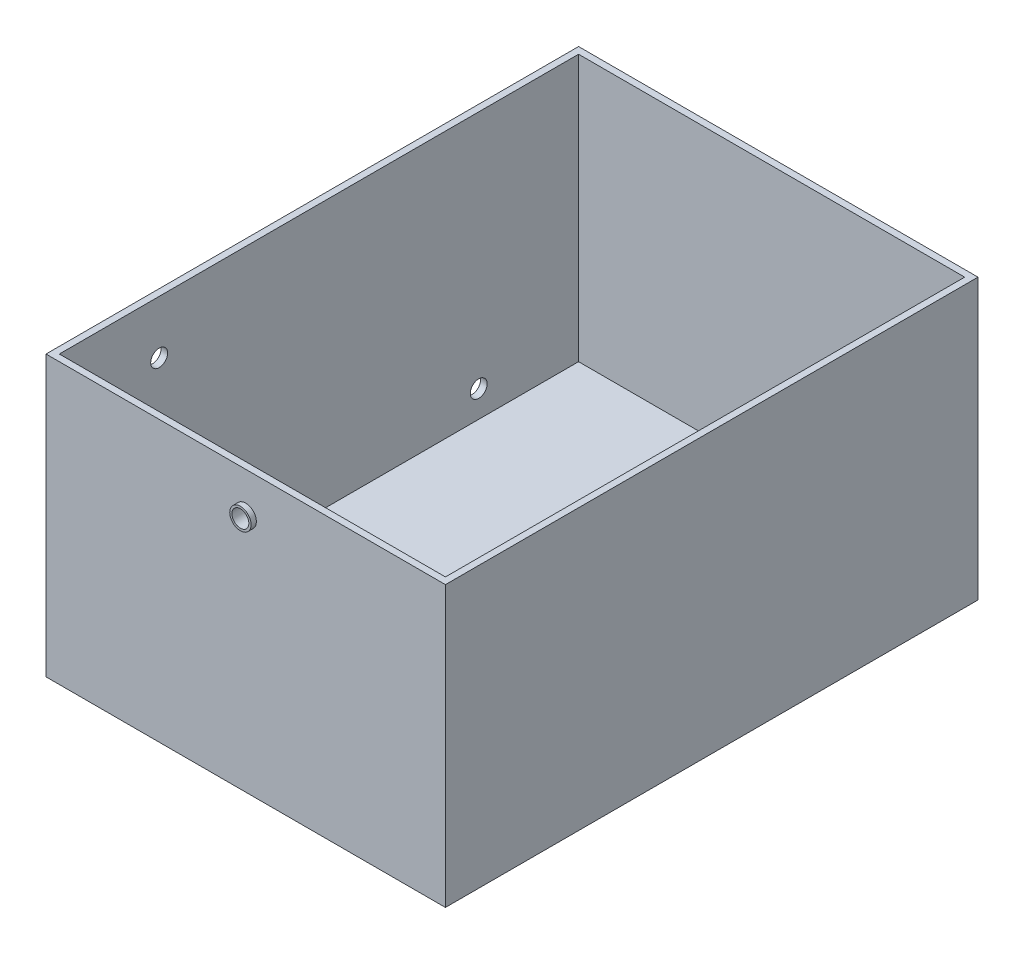
ISO-10303-21;
HEADER;
FILE_DESCRIPTION(('STEP AP214'),'2;1');
FILE_NAME('part.step','',(''),(''),'','','');
FILE_SCHEMA(('AUTOMOTIVE_DESIGN { 1 0 10303 214 1 1 1 1 }'));
ENDSEC;
DATA;
#1=APPLICATION_CONTEXT('core data for automotive mechanical design processes');
#2=APPLICATION_PROTOCOL_DEFINITION('international standard','automotive_design',2000,#1);
#3=PRODUCT_CONTEXT('',#1,'mechanical');
#4=PRODUCT('Part','Part','',(#3));
#5=PRODUCT_RELATED_PRODUCT_CATEGORY('part','',(#4));
#6=PRODUCT_DEFINITION_FORMATION('','',#4);
#7=PRODUCT_DEFINITION_CONTEXT('part definition',#1,'design');
#8=PRODUCT_DEFINITION('design','',#6,#7);
#9=PRODUCT_DEFINITION_SHAPE('','',#8);
#10=(LENGTH_UNIT() NAMED_UNIT(*) SI_UNIT(.MILLI.,.METRE.));
#11=(NAMED_UNIT(*) PLANE_ANGLE_UNIT() SI_UNIT($,.RADIAN.));
#12=(NAMED_UNIT(*) SI_UNIT($,.STERADIAN.) SOLID_ANGLE_UNIT());
#13=UNCERTAINTY_MEASURE_WITH_UNIT(LENGTH_MEASURE(1.E-05),#10,'distance_accuracy_value','');
#14=(GEOMETRIC_REPRESENTATION_CONTEXT(3) GLOBAL_UNCERTAINTY_ASSIGNED_CONTEXT((#13)) GLOBAL_UNIT_ASSIGNED_CONTEXT((#10,
#11,#12)) REPRESENTATION_CONTEXT('',''));
#15=CARTESIAN_POINT('',(0.,0.,0.));
#16=DIRECTION('',(0.,0.,1.));
#17=DIRECTION('',(1.,0.,0.));
#18=AXIS2_PLACEMENT_3D('',#15,#16,#17);
#19=CARTESIAN_POINT('',(-75.,5.,-100.));
#20=DIRECTION('',(0.,0.,1.));
#21=DIRECTION('',(1.,0.,0.));
#22=AXIS2_PLACEMENT_3D('',#19,#20,#21);
#23=PLANE('',#22);
#24=DIRECTION('',(-1.,0.,0.));
#25=VECTOR('',#24,1.);
#26=CARTESIAN_POINT('',(-75.,0.,-100.));
#27=LINE('',#26,#25);
#28=CARTESIAN_POINT('',(75.,0.,-100.));
#29=VERTEX_POINT('',#28);
#30=CARTESIAN_POINT('',(-75.,0.,-100.));
#31=VERTEX_POINT('',#30);
#32=EDGE_CURVE('E166',#29,#31,#27,.T.);
#33=ORIENTED_EDGE('',*,*,#32,.T.);
#34=DIRECTION('',(0.,-1.,0.));
#35=VECTOR('',#34,1.);
#36=CARTESIAN_POINT('',(-75.,5.,-100.));
#37=LINE('',#36,#35);
#38=CARTESIAN_POINT('',(-75.0000000000001,105.,-100.));
#39=VERTEX_POINT('',#38);
#40=EDGE_CURVE('E175',#39,#31,#37,.T.);
#41=ORIENTED_EDGE('',*,*,#40,.F.);
#42=DIRECTION('',(-1.,0.,0.));
#43=VECTOR('',#42,1.);
#44=CARTESIAN_POINT('',(-75.0000000000001,105.,-100.));
#45=LINE('',#44,#43);
#46=CARTESIAN_POINT('',(75.,105.,-100.));
#47=VERTEX_POINT('',#46);
#48=EDGE_CURVE('E154',#47,#39,#45,.T.);
#49=ORIENTED_EDGE('',*,*,#48,.F.);
#50=DIRECTION('',(0.,-1.,0.));
#51=VECTOR('',#50,1.);
#52=CARTESIAN_POINT('',(75.,5.,-100.));
#53=LINE('',#52,#51);
#54=EDGE_CURVE('E178',#47,#29,#53,.T.);
#55=ORIENTED_EDGE('',*,*,#54,.T.);
#56=EDGE_LOOP('',(#33,#41,#49,#55));
#57=FACE_BOUND('',#56,.T.);
#58=CARTESIAN_POINT('',(0.,10.,-100.));
#59=DIRECTION('',(0.,0.,1.));
#60=DIRECTION('',(1.,0.,0.));
#61=AXIS2_PLACEMENT_3D('',#58,#59,#60);
#62=CIRCLE('',#61,4.);
#63=CARTESIAN_POINT('',(4.,10.,-100.));
#64=VERTEX_POINT('',#63);
#65=EDGE_CURVE('E11',#64,#64,#62,.F.);
#66=ORIENTED_EDGE('',*,*,#65,.F.);
#67=EDGE_LOOP('',(#66));
#68=FACE_BOUND('',#67,.T.);
#69=ADVANCED_FACE('F41',(#57,#68),#23,.F.);
#70=CARTESIAN_POINT('',(-75.,5.,100.));
#71=DIRECTION('',(0.,0.,-1.));
#72=DIRECTION('',(-1.,0.,0.));
#73=AXIS2_PLACEMENT_3D('',#70,#71,#72);
#74=PLANE('',#73);
#75=DIRECTION('',(1.,0.,0.));
#76=VECTOR('',#75,1.);
#77=CARTESIAN_POINT('',(-75.,0.,100.));
#78=LINE('',#77,#76);
#79=CARTESIAN_POINT('',(-75.,0.,100.));
#80=VERTEX_POINT('',#79);
#81=CARTESIAN_POINT('',(75.,0.,100.));
#82=VERTEX_POINT('',#81);
#83=EDGE_CURVE('E66',#80,#82,#78,.T.);
#84=ORIENTED_EDGE('',*,*,#83,.T.);
#85=DIRECTION('',(0.,-1.,0.));
#86=VECTOR('',#85,1.);
#87=CARTESIAN_POINT('',(75.,5.,100.));
#88=LINE('',#87,#86);
#89=CARTESIAN_POINT('',(75.,105.,100.));
#90=VERTEX_POINT('',#89);
#91=EDGE_CURVE('E171',#90,#82,#88,.T.);
#92=ORIENTED_EDGE('',*,*,#91,.F.);
#93=DIRECTION('',(1.,0.,0.));
#94=VECTOR('',#93,1.);
#95=CARTESIAN_POINT('',(-75.0000000000001,105.,100.));
#96=LINE('',#95,#94);
#97=CARTESIAN_POINT('',(-75.0000000000001,105.,100.));
#98=VERTEX_POINT('',#97);
#99=EDGE_CURVE('E160',#98,#90,#96,.T.);
#100=ORIENTED_EDGE('',*,*,#99,.F.);
#101=DIRECTION('',(0.,-1.,0.));
#102=VECTOR('',#101,1.);
#103=CARTESIAN_POINT('',(-75.,5.,100.));
#104=LINE('',#103,#102);
#105=EDGE_CURVE('E173',#98,#80,#104,.T.);
#106=ORIENTED_EDGE('',*,*,#105,.T.);
#107=EDGE_LOOP('',(#84,#92,#100,#106));
#108=FACE_BOUND('',#107,.T.);
#109=CARTESIAN_POINT('',(0.,90.,100.));
#110=DIRECTION('',(0.,0.,-1.));
#111=DIRECTION('',(-1.,0.,0.));
#112=AXIS2_PLACEMENT_3D('',#109,#110,#111);
#113=CIRCLE('',#112,4.);
#114=CARTESIAN_POINT('',(-4.,90.,100.));
#115=VERTEX_POINT('',#114);
#116=EDGE_CURVE('E50',#115,#115,#113,.F.);
#117=ORIENTED_EDGE('',*,*,#116,.F.);
#118=EDGE_LOOP('',(#117));
#119=FACE_BOUND('',#118,.T.);
#120=ADVANCED_FACE('F223',(#108,#119),#74,.F.);
#121=CARTESIAN_POINT('',(75.,5.,100.));
#122=DIRECTION('',(-1.,0.,0.));
#123=DIRECTION('',(0.,0.,1.));
#124=AXIS2_PLACEMENT_3D('',#121,#122,#123);
#125=PLANE('',#124);
#126=DIRECTION('',(0.,0.,-1.));
#127=VECTOR('',#126,1.);
#128=CARTESIAN_POINT('',(75.,0.,100.));
#129=LINE('',#128,#127);
#130=EDGE_CURVE('E163',#82,#29,#129,.T.);
#131=ORIENTED_EDGE('',*,*,#130,.T.);
#132=ORIENTED_EDGE('',*,*,#54,.F.);
#133=DIRECTION('',(0.,0.,-1.));
#134=VECTOR('',#133,1.);
#135=CARTESIAN_POINT('',(75.,105.,-100.));
#136=LINE('',#135,#134);
#137=EDGE_CURVE('E126',#90,#47,#136,.T.);
#138=ORIENTED_EDGE('',*,*,#137,.F.);
#139=ORIENTED_EDGE('',*,*,#91,.T.);
#140=EDGE_LOOP('',(#131,#132,#138,#139));
#141=FACE_BOUND('',#140,.T.);
#142=ADVANCED_FACE('F43',(#141),#125,.F.);
#143=CARTESIAN_POINT('',(-75.,5.,100.));
#144=DIRECTION('',(1.,0.,0.));
#145=DIRECTION('',(0.,0.,-1.));
#146=AXIS2_PLACEMENT_3D('',#143,#144,#145);
#147=PLANE('',#146);
#148=CARTESIAN_POINT('',(-75.,15.0000000000001,-60.));
#149=DIRECTION('',(-1.,0.,0.));
#150=DIRECTION('',(0.,0.,1.));
#151=AXIS2_PLACEMENT_3D('',#148,#149,#150);
#152=CIRCLE('',#151,3.17499999609346);
#153=CARTESIAN_POINT('',(-75.,15.0000000000001,-56.8250000039065));
#154=VERTEX_POINT('',#153);
#155=EDGE_CURVE('E192',#154,#154,#152,.T.);
#156=ORIENTED_EDGE('',*,*,#155,.F.);
#157=EDGE_LOOP('',(#156));
#158=FACE_BOUND('',#157,.T.);
#159=CARTESIAN_POINT('',(-75.,85.,60.));
#160=DIRECTION('',(-1.,0.,0.));
#161=DIRECTION('',(0.,0.,1.));
#162=AXIS2_PLACEMENT_3D('',#159,#160,#161);
#163=CIRCLE('',#162,3.175);
#164=CARTESIAN_POINT('',(-75.,85.,63.175));
#165=VERTEX_POINT('',#164);
#166=EDGE_CURVE('E198',#165,#165,#163,.T.);
#167=ORIENTED_EDGE('',*,*,#166,.F.);
#168=EDGE_LOOP('',(#167));
#169=FACE_BOUND('',#168,.T.);
#170=DIRECTION('',(0.,0.,1.));
#171=VECTOR('',#170,1.);
#172=CARTESIAN_POINT('',(-75.,0.,100.));
#173=LINE('',#172,#171);
#174=EDGE_CURVE('E168',#31,#80,#173,.T.);
#175=ORIENTED_EDGE('',*,*,#174,.T.);
#176=ORIENTED_EDGE('',*,*,#105,.F.);
#177=DIRECTION('',(0.,0.,1.));
#178=VECTOR('',#177,1.);
#179=CARTESIAN_POINT('',(-75.0000000000001,105.,-100.));
#180=LINE('',#179,#178);
#181=EDGE_CURVE('E157',#39,#98,#180,.T.);
#182=ORIENTED_EDGE('',*,*,#181,.F.);
#183=ORIENTED_EDGE('',*,*,#40,.T.);
#184=EDGE_LOOP('',(#175,#176,#182,#183));
#185=FACE_BOUND('',#184,.T.);
#186=ADVANCED_FACE('F231',(#158,#169,#185),#147,.F.);
#187=CARTESIAN_POINT('',(0.,0.,0.));
#188=DIRECTION('',(0.,-1.,0.));
#189=DIRECTION('',(0.,0.,-1.));
#190=AXIS2_PLACEMENT_3D('',#187,#188,#189);
#191=PLANE('',#190);
#192=ORIENTED_EDGE('',*,*,#130,.F.);
#193=ORIENTED_EDGE('',*,*,#83,.F.);
#194=ORIENTED_EDGE('',*,*,#174,.F.);
#195=ORIENTED_EDGE('',*,*,#32,.F.);
#196=EDGE_LOOP('',(#192,#193,#194,#195));
#197=FACE_BOUND('',#196,.T.);
#198=ADVANCED_FACE('F237',(#197),#191,.T.);
#199=CARTESIAN_POINT('',(0.,105.,0.));
#200=DIRECTION('',(0.,1.,0.));
#201=DIRECTION('',(0.,0.,1.));
#202=AXIS2_PLACEMENT_3D('',#199,#200,#201);
#203=PLANE('',#202);
#204=ORIENTED_EDGE('',*,*,#137,.T.);
#205=ORIENTED_EDGE('',*,*,#48,.T.);
#206=ORIENTED_EDGE('',*,*,#181,.T.);
#207=ORIENTED_EDGE('',*,*,#99,.T.);
#208=EDGE_LOOP('',(#204,#205,#206,#207));
#209=FACE_BOUND('',#208,.T.);
#210=DIRECTION('',(-1.,0.,0.));
#211=VECTOR('',#210,1.);
#212=CARTESIAN_POINT('',(-72.5,105.,-97.5));
#213=LINE('',#212,#211);
#214=CARTESIAN_POINT('',(72.5,105.,-97.5));
#215=VERTEX_POINT('',#214);
#216=CARTESIAN_POINT('',(-72.5,105.,-97.5));
#217=VERTEX_POINT('',#216);
#218=EDGE_CURVE('E118',#215,#217,#213,.T.);
#219=ORIENTED_EDGE('',*,*,#218,.F.);
#220=DIRECTION('',(0.,0.,-1.));
#221=VECTOR('',#220,1.);
#222=CARTESIAN_POINT('',(72.5,105.,97.5));
#223=LINE('',#222,#221);
#224=CARTESIAN_POINT('',(72.5,105.,97.5));
#225=VERTEX_POINT('',#224);
#226=EDGE_CURVE('E110',#225,#215,#223,.T.);
#227=ORIENTED_EDGE('',*,*,#226,.F.);
#228=DIRECTION('',(1.,0.,0.));
#229=VECTOR('',#228,1.);
#230=CARTESIAN_POINT('',(-72.5,105.,97.5));
#231=LINE('',#230,#229);
#232=CARTESIAN_POINT('',(-72.5,105.,97.5));
#233=VERTEX_POINT('',#232);
#234=EDGE_CURVE('E134',#233,#225,#231,.T.);
#235=ORIENTED_EDGE('',*,*,#234,.F.);
#236=DIRECTION('',(0.,0.,1.));
#237=VECTOR('',#236,1.);
#238=CARTESIAN_POINT('',(-72.5,105.,97.5));
#239=LINE('',#238,#237);
#240=EDGE_CURVE('E132',#217,#233,#239,.T.);
#241=ORIENTED_EDGE('',*,*,#240,.F.);
#242=EDGE_LOOP('',(#219,#227,#235,#241));
#243=FACE_BOUND('',#242,.T.);
#244=ADVANCED_FACE('F130',(#209,#243),#203,.T.);
#245=CARTESIAN_POINT('',(72.5,105.,97.5));
#246=DIRECTION('',(-1.,0.,0.));
#247=DIRECTION('',(0.,0.,1.));
#248=AXIS2_PLACEMENT_3D('',#245,#246,#247);
#249=PLANE('',#248);
#250=DIRECTION('',(0.,0.,-1.));
#251=VECTOR('',#250,1.);
#252=CARTESIAN_POINT('',(72.5,5.,97.5));
#253=LINE('',#252,#251);
#254=CARTESIAN_POINT('',(72.5,5.,97.5));
#255=VERTEX_POINT('',#254);
#256=CARTESIAN_POINT('',(72.5,5.,-97.5));
#257=VERTEX_POINT('',#256);
#258=EDGE_CURVE('E139',#255,#257,#253,.T.);
#259=ORIENTED_EDGE('',*,*,#258,.F.);
#260=DIRECTION('',(0.,-1.,0.));
#261=VECTOR('',#260,1.);
#262=CARTESIAN_POINT('',(72.5,105.,97.5));
#263=LINE('',#262,#261);
#264=EDGE_CURVE('E58',#225,#255,#263,.T.);
#265=ORIENTED_EDGE('',*,*,#264,.F.);
#266=ORIENTED_EDGE('',*,*,#226,.T.);
#267=DIRECTION('',(0.,-1.,0.));
#268=VECTOR('',#267,1.);
#269=CARTESIAN_POINT('',(72.5,105.,-97.5));
#270=LINE('',#269,#268);
#271=EDGE_CURVE('E113',#215,#257,#270,.T.);
#272=ORIENTED_EDGE('',*,*,#271,.T.);
#273=EDGE_LOOP('',(#259,#265,#266,#272));
#274=FACE_BOUND('',#273,.T.);
#275=ADVANCED_FACE('F112',(#274),#249,.T.);
#276=CARTESIAN_POINT('',(-72.5,105.,-97.5));
#277=DIRECTION('',(0.,0.,1.));
#278=DIRECTION('',(1.,0.,0.));
#279=AXIS2_PLACEMENT_3D('',#276,#277,#278);
#280=PLANE('',#279);
#281=CARTESIAN_POINT('',(0.,10.,-97.5));
#282=DIRECTION('',(0.,0.,1.));
#283=DIRECTION('',(1.,0.,0.));
#284=AXIS2_PLACEMENT_3D('',#281,#282,#283);
#285=CIRCLE('',#284,3.175);
#286=CARTESIAN_POINT('',(3.175,10.,-97.5));
#287=VERTEX_POINT('',#286);
#288=EDGE_CURVE('E186',#287,#287,#285,.T.);
#289=ORIENTED_EDGE('',*,*,#288,.F.);
#290=EDGE_LOOP('',(#289));
#291=FACE_BOUND('',#290,.T.);
#292=DIRECTION('',(-1.,0.,0.));
#293=VECTOR('',#292,1.);
#294=CARTESIAN_POINT('',(-72.5,5.,-97.5));
#295=LINE('',#294,#293);
#296=CARTESIAN_POINT('',(-72.5,5.,-97.5));
#297=VERTEX_POINT('',#296);
#298=EDGE_CURVE('E125',#257,#297,#295,.T.);
#299=ORIENTED_EDGE('',*,*,#298,.F.);
#300=ORIENTED_EDGE('',*,*,#271,.F.);
#301=ORIENTED_EDGE('',*,*,#218,.T.);
#302=DIRECTION('',(0.,-1.,0.));
#303=VECTOR('',#302,1.);
#304=CARTESIAN_POINT('',(-72.5,105.,-97.5));
#305=LINE('',#304,#303);
#306=EDGE_CURVE('E127',#217,#297,#305,.T.);
#307=ORIENTED_EDGE('',*,*,#306,.T.);
#308=EDGE_LOOP('',(#299,#300,#301,#307));
#309=FACE_BOUND('',#308,.T.);
#310=ADVANCED_FACE('F122',(#291,#309),#280,.T.);
#311=CARTESIAN_POINT('',(-72.5,105.,97.5));
#312=DIRECTION('',(1.,0.,0.));
#313=DIRECTION('',(0.,0.,-1.));
#314=AXIS2_PLACEMENT_3D('',#311,#312,#313);
#315=PLANE('',#314);
#316=CARTESIAN_POINT('',(-72.5,15.0000000000001,-60.));
#317=DIRECTION('',(1.,0.,0.));
#318=DIRECTION('',(0.,0.,-1.));
#319=AXIS2_PLACEMENT_3D('',#316,#317,#318);
#320=CIRCLE('',#319,3.17499999609346);
#321=CARTESIAN_POINT('',(-72.5,15.0000000000001,-63.1749999960935));
#322=VERTEX_POINT('',#321);
#323=EDGE_CURVE('E45',#322,#322,#320,.T.);
#324=ORIENTED_EDGE('',*,*,#323,.F.);
#325=EDGE_LOOP('',(#324));
#326=FACE_BOUND('',#325,.T.);
#327=CARTESIAN_POINT('',(-72.5,85.,60.));
#328=DIRECTION('',(1.,0.,0.));
#329=DIRECTION('',(0.,0.,-1.));
#330=AXIS2_PLACEMENT_3D('',#327,#328,#329);
#331=CIRCLE('',#330,3.175);
#332=CARTESIAN_POINT('',(-72.5,85.,56.825));
#333=VERTEX_POINT('',#332);
#334=EDGE_CURVE('E190',#333,#333,#331,.T.);
#335=ORIENTED_EDGE('',*,*,#334,.F.);
#336=EDGE_LOOP('',(#335));
#337=FACE_BOUND('',#336,.T.);
#338=DIRECTION('',(0.,0.,1.));
#339=VECTOR('',#338,1.);
#340=CARTESIAN_POINT('',(-72.5,5.,97.5));
#341=LINE('',#340,#339);
#342=CARTESIAN_POINT('',(-72.5,5.,97.5));
#343=VERTEX_POINT('',#342);
#344=EDGE_CURVE('E143',#297,#343,#341,.T.);
#345=ORIENTED_EDGE('',*,*,#344,.F.);
#346=ORIENTED_EDGE('',*,*,#306,.F.);
#347=ORIENTED_EDGE('',*,*,#240,.T.);
#348=DIRECTION('',(0.,-1.,0.));
#349=VECTOR('',#348,1.);
#350=CARTESIAN_POINT('',(-72.5,105.,97.5));
#351=LINE('',#350,#349);
#352=EDGE_CURVE('E149',#233,#343,#351,.T.);
#353=ORIENTED_EDGE('',*,*,#352,.T.);
#354=EDGE_LOOP('',(#345,#346,#347,#353));
#355=FACE_BOUND('',#354,.T.);
#356=ADVANCED_FACE('F287',(#326,#337,#355),#315,.T.);
#357=CARTESIAN_POINT('',(-72.5,105.,97.5));
#358=DIRECTION('',(0.,0.,-1.));
#359=DIRECTION('',(-1.,0.,0.));
#360=AXIS2_PLACEMENT_3D('',#357,#358,#359);
#361=PLANE('',#360);
#362=CARTESIAN_POINT('',(0.,90.,97.5));
#363=DIRECTION('',(0.,0.,-1.));
#364=DIRECTION('',(-1.,0.,0.));
#365=AXIS2_PLACEMENT_3D('',#362,#363,#364);
#366=CIRCLE('',#365,3.175);
#367=CARTESIAN_POINT('',(-3.175,90.,97.5));
#368=VERTEX_POINT('',#367);
#369=EDGE_CURVE('E141',#368,#368,#366,.T.);
#370=ORIENTED_EDGE('',*,*,#369,.F.);
#371=EDGE_LOOP('',(#370));
#372=FACE_BOUND('',#371,.T.);
#373=DIRECTION('',(1.,0.,0.));
#374=VECTOR('',#373,1.);
#375=CARTESIAN_POINT('',(-72.5,5.,97.5));
#376=LINE('',#375,#374);
#377=EDGE_CURVE('E119',#343,#255,#376,.T.);
#378=ORIENTED_EDGE('',*,*,#377,.F.);
#379=ORIENTED_EDGE('',*,*,#352,.F.);
#380=ORIENTED_EDGE('',*,*,#234,.T.);
#381=ORIENTED_EDGE('',*,*,#264,.T.);
#382=EDGE_LOOP('',(#378,#379,#380,#381));
#383=FACE_BOUND('',#382,.T.);
#384=ADVANCED_FACE('F284',(#372,#383),#361,.T.);
#385=CARTESIAN_POINT('',(0.,5.,0.));
#386=DIRECTION('',(0.,-1.,0.));
#387=DIRECTION('',(0.,0.,-1.));
#388=AXIS2_PLACEMENT_3D('',#385,#386,#387);
#389=PLANE('',#388);
#390=ORIENTED_EDGE('',*,*,#377,.T.);
#391=ORIENTED_EDGE('',*,*,#258,.T.);
#392=ORIENTED_EDGE('',*,*,#298,.T.);
#393=ORIENTED_EDGE('',*,*,#344,.T.);
#394=EDGE_LOOP('',(#390,#391,#392,#393));
#395=FACE_BOUND('',#394,.T.);
#396=ADVANCED_FACE('F282',(#395),#389,.F.);
#397=CARTESIAN_POINT('',(0.,90.,50.));
#398=DIRECTION('',(0.,0.,1.));
#399=DIRECTION('',(1.,0.,0.));
#400=AXIS2_PLACEMENT_3D('',#397,#398,#399);
#401=CYLINDRICAL_SURFACE('',#400,3.175);
#402=ORIENTED_EDGE('',*,*,#369,.T.);
#403=EDGE_LOOP('',(#402));
#404=FACE_BOUND('',#403,.T.);
#405=CARTESIAN_POINT('',(0.,90.,102.));
#406=DIRECTION('',(0.,0.,1.));
#407=DIRECTION('',(1.,0.,0.));
#408=AXIS2_PLACEMENT_3D('',#405,#406,#407);
#409=CIRCLE('',#408,3.175);
#410=CARTESIAN_POINT('',(3.175,90.,102.));
#411=VERTEX_POINT('',#410);
#412=EDGE_CURVE('E188',#411,#411,#409,.T.);
#413=ORIENTED_EDGE('',*,*,#412,.T.);
#414=EDGE_LOOP('',(#413));
#415=FACE_BOUND('',#414,.T.);
#416=ADVANCED_FACE('F279',(#404,#415),#401,.F.);
#417=CARTESIAN_POINT('',(0.,90.,102.));
#418=DIRECTION('',(0.,0.,1.));
#419=DIRECTION('',(1.,0.,0.));
#420=AXIS2_PLACEMENT_3D('',#417,#418,#419);
#421=PLANE('',#420);
#422=CARTESIAN_POINT('',(0.,90.,102.));
#423=DIRECTION('',(0.,0.,1.));
#424=DIRECTION('',(1.,0.,0.));
#425=AXIS2_PLACEMENT_3D('',#422,#423,#424);
#426=CIRCLE('',#425,4.);
#427=CARTESIAN_POINT('',(4.,90.,102.));
#428=VERTEX_POINT('',#427);
#429=EDGE_CURVE('E183',#428,#428,#426,.T.);
#430=ORIENTED_EDGE('',*,*,#429,.T.);
#431=EDGE_LOOP('',(#430));
#432=FACE_BOUND('',#431,.T.);
#433=ORIENTED_EDGE('',*,*,#412,.F.);
#434=EDGE_LOOP('',(#433));
#435=FACE_BOUND('',#434,.T.);
#436=ADVANCED_FACE('F213',(#432,#435),#421,.T.);
#437=CARTESIAN_POINT('',(0.,90.,102.));
#438=DIRECTION('',(0.,0.,-1.));
#439=DIRECTION('',(-1.,0.,0.));
#440=AXIS2_PLACEMENT_3D('',#437,#438,#439);
#441=CYLINDRICAL_SURFACE('',#440,4.);
#442=ORIENTED_EDGE('',*,*,#429,.F.);
#443=EDGE_LOOP('',(#442));
#444=FACE_BOUND('',#443,.T.);
#445=ORIENTED_EDGE('',*,*,#116,.T.);
#446=EDGE_LOOP('',(#445));
#447=FACE_BOUND('',#446,.T.);
#448=ADVANCED_FACE('F216',(#444,#447),#441,.T.);
#449=CARTESIAN_POINT('',(0.,10.,-86.));
#450=DIRECTION('',(0.,0.,-1.));
#451=DIRECTION('',(-1.,0.,0.));
#452=AXIS2_PLACEMENT_3D('',#449,#450,#451);
#453=CYLINDRICAL_SURFACE('',#452,3.175);
#454=ORIENTED_EDGE('',*,*,#288,.T.);
#455=EDGE_LOOP('',(#454));
#456=FACE_BOUND('',#455,.T.);
#457=CARTESIAN_POINT('',(0.,10.,-102.));
#458=DIRECTION('',(0.,0.,-1.));
#459=DIRECTION('',(-1.,0.,0.));
#460=AXIS2_PLACEMENT_3D('',#457,#458,#459);
#461=CIRCLE('',#460,3.175);
#462=CARTESIAN_POINT('',(-3.175,10.,-102.));
#463=VERTEX_POINT('',#462);
#464=EDGE_CURVE('E196',#463,#463,#461,.T.);
#465=ORIENTED_EDGE('',*,*,#464,.T.);
#466=EDGE_LOOP('',(#465));
#467=FACE_BOUND('',#466,.T.);
#468=ADVANCED_FACE('F219',(#456,#467),#453,.F.);
#469=CARTESIAN_POINT('',(0.,10.,-102.));
#470=DIRECTION('',(0.,0.,-1.));
#471=DIRECTION('',(-1.,0.,0.));
#472=AXIS2_PLACEMENT_3D('',#469,#470,#471);
#473=PLANE('',#472);
#474=CARTESIAN_POINT('',(0.,10.,-102.));
#475=DIRECTION('',(0.,0.,-1.));
#476=DIRECTION('',(-1.,0.,0.));
#477=AXIS2_PLACEMENT_3D('',#474,#475,#476);
#478=CIRCLE('',#477,4.);
#479=CARTESIAN_POINT('',(-4.,10.,-102.));
#480=VERTEX_POINT('',#479);
#481=EDGE_CURVE('E189',#480,#480,#478,.T.);
#482=ORIENTED_EDGE('',*,*,#481,.T.);
#483=EDGE_LOOP('',(#482));
#484=FACE_BOUND('',#483,.T.);
#485=ORIENTED_EDGE('',*,*,#464,.F.);
#486=EDGE_LOOP('',(#485));
#487=FACE_BOUND('',#486,.T.);
#488=ADVANCED_FACE('F262',(#484,#487),#473,.T.);
#489=CARTESIAN_POINT('',(0.,10.,-102.));
#490=DIRECTION('',(0.,0.,1.));
#491=DIRECTION('',(1.,0.,0.));
#492=AXIS2_PLACEMENT_3D('',#489,#490,#491);
#493=CYLINDRICAL_SURFACE('',#492,4.);
#494=ORIENTED_EDGE('',*,*,#481,.F.);
#495=EDGE_LOOP('',(#494));
#496=FACE_BOUND('',#495,.T.);
#497=ORIENTED_EDGE('',*,*,#65,.T.);
#498=EDGE_LOOP('',(#497));
#499=FACE_BOUND('',#498,.T.);
#500=ADVANCED_FACE('F260',(#496,#499),#493,.T.);
#501=CARTESIAN_POINT('',(-65.,85.,60.));
#502=DIRECTION('',(-1.,0.,0.));
#503=DIRECTION('',(0.,0.,1.));
#504=AXIS2_PLACEMENT_3D('',#501,#502,#503);
#505=CYLINDRICAL_SURFACE('',#504,3.175);
#506=ORIENTED_EDGE('',*,*,#334,.T.);
#507=EDGE_LOOP('',(#506));
#508=FACE_BOUND('',#507,.T.);
#509=ORIENTED_EDGE('',*,*,#166,.T.);
#510=EDGE_LOOP('',(#509));
#511=FACE_BOUND('',#510,.T.);
#512=ADVANCED_FACE('F261',(#508,#511),#505,.F.);
#513=CARTESIAN_POINT('',(-65.,15.0000000000001,-60.));
#514=DIRECTION('',(-1.,0.,0.));
#515=DIRECTION('',(0.,0.,1.));
#516=AXIS2_PLACEMENT_3D('',#513,#514,#515);
#517=CYLINDRICAL_SURFACE('',#516,3.17499999609346);
#518=ORIENTED_EDGE('',*,*,#323,.T.);
#519=EDGE_LOOP('',(#518));
#520=FACE_BOUND('',#519,.T.);
#521=ORIENTED_EDGE('',*,*,#155,.T.);
#522=EDGE_LOOP('',(#521));
#523=FACE_BOUND('',#522,.T.);
#524=ADVANCED_FACE('F269',(#520,#523),#517,.F.);
#525=CLOSED_SHELL('',(#69,#120,#142,#186,#198,#244,#275,#310,#356,#384,#396,#416,#436,#448,#468,
#488,#500,#512,#524));
#526=MANIFOLD_SOLID_BREP('B2',#525);
#527=ADVANCED_BREP_SHAPE_REPRESENTATION('',(#18,#526),#14);
#528=SHAPE_DEFINITION_REPRESENTATION(#9,#527);
ENDSEC;
END-ISO-10303-21;
